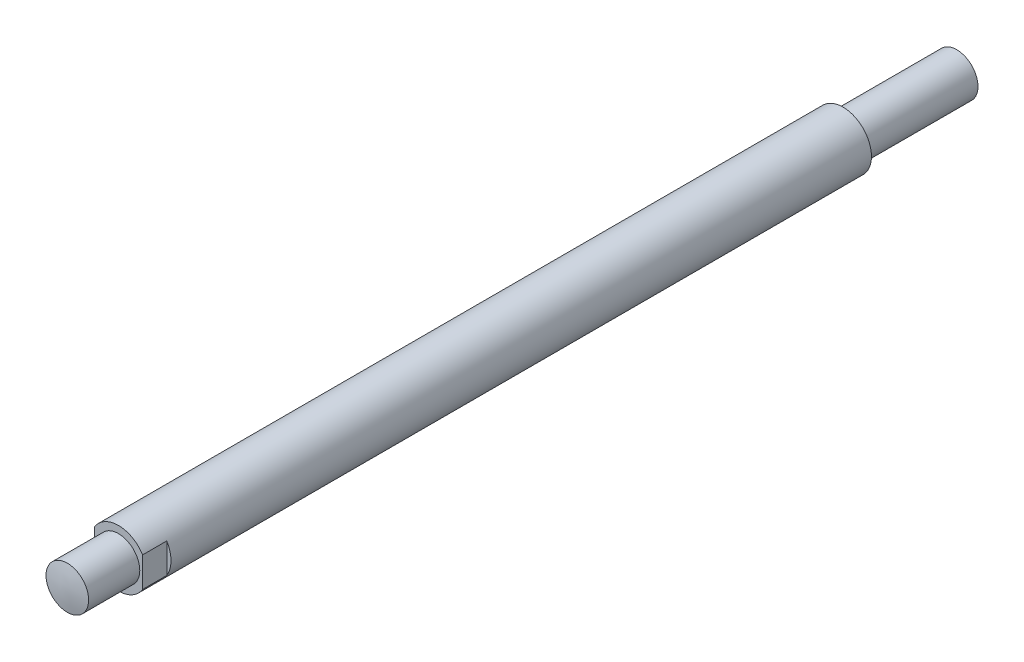
ISO-10303-21;
HEADER;
FILE_DESCRIPTION(('STEP AP214'),'2;1');
FILE_NAME('part.step','',(''),(''),'','','');
FILE_SCHEMA(('AUTOMOTIVE_DESIGN { 1 0 10303 214 1 1 1 1 }'));
ENDSEC;
DATA;
#1=APPLICATION_CONTEXT('core data for automotive mechanical design processes');
#2=APPLICATION_PROTOCOL_DEFINITION('international standard','automotive_design',2000,#1);
#3=PRODUCT_CONTEXT('',#1,'mechanical');
#4=PRODUCT('Part','Part','',(#3));
#5=PRODUCT_RELATED_PRODUCT_CATEGORY('part','',(#4));
#6=PRODUCT_DEFINITION_FORMATION('','',#4);
#7=PRODUCT_DEFINITION_CONTEXT('part definition',#1,'design');
#8=PRODUCT_DEFINITION('design','',#6,#7);
#9=PRODUCT_DEFINITION_SHAPE('','',#8);
#10=(LENGTH_UNIT() NAMED_UNIT(*) SI_UNIT(.MILLI.,.METRE.));
#11=(NAMED_UNIT(*) PLANE_ANGLE_UNIT() SI_UNIT($,.RADIAN.));
#12=(NAMED_UNIT(*) SI_UNIT($,.STERADIAN.) SOLID_ANGLE_UNIT());
#13=UNCERTAINTY_MEASURE_WITH_UNIT(LENGTH_MEASURE(1.E-05),#10,'distance_accuracy_value','');
#14=(GEOMETRIC_REPRESENTATION_CONTEXT(3) GLOBAL_UNCERTAINTY_ASSIGNED_CONTEXT((#13)) GLOBAL_UNIT_ASSIGNED_CONTEXT((#10,
#11,#12)) REPRESENTATION_CONTEXT('',''));
#15=CARTESIAN_POINT('',(0.,0.,0.));
#16=DIRECTION('',(0.,0.,1.));
#17=DIRECTION('',(1.,0.,0.));
#18=AXIS2_PLACEMENT_3D('',#15,#16,#17);
#19=CARTESIAN_POINT('',(0.,0.,255.));
#20=DIRECTION('',(0.,0.,-1.));
#21=DIRECTION('',(-1.,0.,0.));
#22=AXIS2_PLACEMENT_3D('',#19,#20,#21);
#23=CYLINDRICAL_SURFACE('',#22,20.);
#24=CARTESIAN_POINT('',(0.,0.,255.));
#25=DIRECTION('',(0.,0.,1.));
#26=DIRECTION('',(1.,0.,0.));
#27=AXIS2_PLACEMENT_3D('',#24,#25,#26);
#28=CIRCLE('',#27,20.);
#29=CARTESIAN_POINT('',(-17.,-10.5356537528527,255.));
#30=VERTEX_POINT('',#29);
#31=CARTESIAN_POINT('',(17.,-10.5356537528527,255.));
#32=VERTEX_POINT('',#31);
#33=EDGE_CURVE('E205',#30,#32,#28,.T.);
#34=ORIENTED_EDGE('',*,*,#33,.F.);
#35=DIRECTION('',(0.,0.,-1.));
#36=VECTOR('',#35,1.);
#37=CARTESIAN_POINT('',(-17.,-10.5356537528527,255.));
#38=LINE('',#37,#36);
#39=CARTESIAN_POINT('',(-17.,-10.5356537528527,238.));
#40=VERTEX_POINT('',#39);
#41=EDGE_CURVE('E163',#30,#40,#38,.T.);
#42=ORIENTED_EDGE('',*,*,#41,.T.);
#43=CARTESIAN_POINT('',(0.,0.,238.));
#44=DIRECTION('',(0.,0.,-1.));
#45=DIRECTION('',(-1.,0.,0.));
#46=AXIS2_PLACEMENT_3D('',#43,#44,#45);
#47=CIRCLE('',#46,20.);
#48=CARTESIAN_POINT('',(-17.,10.5356537528527,238.));
#49=VERTEX_POINT('',#48);
#50=EDGE_CURVE('E155',#40,#49,#47,.T.);
#51=ORIENTED_EDGE('',*,*,#50,.T.);
#52=DIRECTION('',(0.,0.,-1.));
#53=VECTOR('',#52,1.);
#54=CARTESIAN_POINT('',(-17.,10.5356537528527,255.));
#55=LINE('',#54,#53);
#56=CARTESIAN_POINT('',(-17.,10.5356537528527,255.));
#57=VERTEX_POINT('',#56);
#58=EDGE_CURVE('E389',#49,#57,#55,.F.);
#59=ORIENTED_EDGE('',*,*,#58,.T.);
#60=CARTESIAN_POINT('',(17.,10.5356537528527,255.));
#61=VERTEX_POINT('',#60);
#62=EDGE_CURVE('E213',#61,#57,#28,.T.);
#63=ORIENTED_EDGE('',*,*,#62,.F.);
#64=DIRECTION('',(0.,0.,-1.));
#65=VECTOR('',#64,1.);
#66=CARTESIAN_POINT('',(17.,10.5356537528527,255.));
#67=LINE('',#66,#65);
#68=CARTESIAN_POINT('',(17.,10.5356537528527,238.));
#69=VERTEX_POINT('',#68);
#70=EDGE_CURVE('E171',#61,#69,#67,.T.);
#71=ORIENTED_EDGE('',*,*,#70,.T.);
#72=CARTESIAN_POINT('',(0.,0.,238.));
#73=DIRECTION('',(0.,0.,1.));
#74=DIRECTION('',(1.,0.,0.));
#75=AXIS2_PLACEMENT_3D('',#72,#73,#74);
#76=CIRCLE('',#75,20.);
#77=CARTESIAN_POINT('',(17.,-10.5356537528527,238.));
#78=VERTEX_POINT('',#77);
#79=EDGE_CURVE('E206',#78,#69,#76,.T.);
#80=ORIENTED_EDGE('',*,*,#79,.F.);
#81=DIRECTION('',(0.,0.,-1.));
#82=VECTOR('',#81,1.);
#83=CARTESIAN_POINT('',(17.,-10.5356537528527,255.));
#84=LINE('',#83,#82);
#85=EDGE_CURVE('E191',#78,#32,#84,.F.);
#86=ORIENTED_EDGE('',*,*,#85,.T.);
#87=EDGE_LOOP('',(#34,#42,#51,#59,#63,#71,#80,#86));
#88=FACE_BOUND('',#87,.T.);
#89=CARTESIAN_POINT('',(0.,0.,-255.));
#90=DIRECTION('',(0.,0.,1.));
#91=DIRECTION('',(1.,0.,0.));
#92=AXIS2_PLACEMENT_3D('',#89,#90,#91);
#93=CIRCLE('',#92,20.);
#94=CARTESIAN_POINT('',(20.,0.,-255.));
#95=VERTEX_POINT('',#94);
#96=EDGE_CURVE('E214',#95,#95,#93,.T.);
#97=ORIENTED_EDGE('',*,*,#96,.T.);
#98=EDGE_LOOP('',(#97));
#99=FACE_BOUND('',#98,.T.);
#100=ADVANCED_FACE('F138',(#88,#99),#23,.T.);
#101=CARTESIAN_POINT('',(0.,0.,255.));
#102=DIRECTION('',(0.,0.,1.));
#103=DIRECTION('',(1.,0.,0.));
#104=AXIS2_PLACEMENT_3D('',#101,#102,#103);
#105=PLANE('',#104);
#106=DIRECTION('',(0.,1.,0.));
#107=VECTOR('',#106,1.);
#108=CARTESIAN_POINT('',(-17.,0.,255.));
#109=LINE('',#108,#107);
#110=EDGE_CURVE('E198',#30,#57,#109,.T.);
#111=ORIENTED_EDGE('',*,*,#110,.F.);
#112=ORIENTED_EDGE('',*,*,#33,.T.);
#113=DIRECTION('',(0.,-1.,0.));
#114=VECTOR('',#113,1.);
#115=CARTESIAN_POINT('',(17.,0.,255.));
#116=LINE('',#115,#114);
#117=EDGE_CURVE('E188',#61,#32,#116,.T.);
#118=ORIENTED_EDGE('',*,*,#117,.F.);
#119=ORIENTED_EDGE('',*,*,#62,.T.);
#120=EDGE_LOOP('',(#111,#112,#118,#119));
#121=FACE_BOUND('',#120,.T.);
#122=CARTESIAN_POINT('',(0.,0.,255.));
#123=DIRECTION('',(0.,0.,1.));
#124=DIRECTION('',(1.,0.,0.));
#125=AXIS2_PLACEMENT_3D('',#122,#123,#124);
#126=CIRCLE('',#125,15.);
#127=CARTESIAN_POINT('',(15.,0.,255.));
#128=VERTEX_POINT('',#127);
#129=EDGE_CURVE('E199',#128,#128,#126,.T.);
#130=ORIENTED_EDGE('',*,*,#129,.F.);
#131=EDGE_LOOP('',(#130));
#132=FACE_BOUND('',#131,.T.);
#133=ADVANCED_FACE('F210',(#121,#132),#105,.T.);
#134=CARTESIAN_POINT('',(0.,0.,-255.));
#135=DIRECTION('',(0.,0.,1.));
#136=DIRECTION('',(1.,0.,0.));
#137=AXIS2_PLACEMENT_3D('',#134,#135,#136);
#138=PLANE('',#137);
#139=CARTESIAN_POINT('',(0.,0.,-255.));
#140=DIRECTION('',(0.,0.,-1.));
#141=DIRECTION('',(-1.,0.,0.));
#142=AXIS2_PLACEMENT_3D('',#139,#140,#141);
#143=CIRCLE('',#142,15.);
#144=CARTESIAN_POINT('',(-15.,0.,-255.));
#145=VERTEX_POINT('',#144);
#146=EDGE_CURVE('E13',#145,#145,#143,.T.);
#147=ORIENTED_EDGE('',*,*,#146,.F.);
#148=EDGE_LOOP('',(#147));
#149=FACE_BOUND('',#148,.T.);
#150=ORIENTED_EDGE('',*,*,#96,.F.);
#151=EDGE_LOOP('',(#150));
#152=FACE_BOUND('',#151,.T.);
#153=ADVANCED_FACE('F255',(#149,#152),#138,.F.);
#154=CARTESIAN_POINT('',(0.,0.,291.));
#155=DIRECTION('',(0.,0.,-1.));
#156=DIRECTION('',(-1.,0.,0.));
#157=AXIS2_PLACEMENT_3D('',#154,#155,#156);
#158=CYLINDRICAL_SURFACE('',#157,15.);
#159=CARTESIAN_POINT('',(-15.,6.22115206572182E-13,290.99987129906));
#160=CARTESIAN_POINT('',(-15.000003023853,-0.421429968077825,290.999871195107));
#161=CARTESIAN_POINT('',(-14.9822323766538,-0.842810312725938,290.999885934263));
#162=CARTESIAN_POINT('',(-14.9112738419773,-1.6827165523157,290.999938409822));
#163=CARTESIAN_POINT('',(-14.8580766370507,-2.10124166704795,290.999976152273));
#164=CARTESIAN_POINT('',(-14.7165536864597,-2.93276682212971,291.000058765728));
#165=CARTESIAN_POINT('',(-14.6281901845041,-3.34576042934893,291.000103644362));
#166=CARTESIAN_POINT('',(-14.4169655841019,-4.1628297430775,291.000181776484));
#167=CARTESIAN_POINT('',(-14.2941046103744,-4.56690548182202,291.000215030014));
#168=CARTESIAN_POINT('',(-14.0148269284681,-5.36306909865374,291.000257479866));
#169=CARTESIAN_POINT('',(-13.8584264957458,-5.75516268617127,291.000266687828));
#170=CARTESIAN_POINT('',(-13.5131442516947,-6.52478498545492,291.000261300724));
#171=CARTESIAN_POINT('',(-13.324261927443,-6.90231346710758,291.000246705281));
#172=CARTESIAN_POINT('',(-12.9154129806584,-7.64001993329824,291.00020669812));
#173=CARTESIAN_POINT('',(-12.6954542926542,-8.00020231532584,291.000181289159));
#174=CARTESIAN_POINT('',(-12.2259806463232,-8.70075815353112,291.000138025461));
#175=CARTESIAN_POINT('',(-11.9764658036638,-9.04113168722254,291.000120170693));
#176=CARTESIAN_POINT('',(-11.4496245957236,-9.6996870942965,291.000104023798));
#177=CARTESIAN_POINT('',(-11.1722952780295,-10.0178666057674,291.000105733751));
#178=CARTESIAN_POINT('',(-10.59181850848,-10.629732554616,291.000125099075));
#179=CARTESIAN_POINT('',(-10.2886710304257,-10.9234189671388,291.000142754463));
#180=CARTESIAN_POINT('',(-9.65870101247631,-11.4842214392565,291.000175221778));
#181=CARTESIAN_POINT('',(-9.33187755155794,-11.7513364642334,291.000190033594));
#182=CARTESIAN_POINT('',(-8.65688967647293,-12.2570840089198,291.000195526217));
#183=CARTESIAN_POINT('',(-8.30872526652063,-12.4957165342539,291.000186207027));
#184=CARTESIAN_POINT('',(-7.5935374164228,-12.9427983902209,291.000138177528));
#185=CARTESIAN_POINT('',(-7.22651432644996,-13.1512482810183,291.000099467764));
#186=CARTESIAN_POINT('',(-6.47621248377215,-13.5364881903353,291.000014770293));
#187=CARTESIAN_POINT('',(-6.09293373076974,-13.7132782082756,290.999968782586));
#188=CARTESIAN_POINT('',(-5.31284624377602,-14.0339411690287,290.999907092489));
#189=CARTESIAN_POINT('',(-4.9160375371585,-14.1778141784345,290.999891390038));
#190=CARTESIAN_POINT('',(-4.11171047808972,-14.4316207298817,290.999912906413));
#191=CARTESIAN_POINT('',(-3.70419212563181,-14.541554271902,290.999950125239));
#192=CARTESIAN_POINT('',(-2.88134222788374,-14.7267004980474,291.000017958233));
#193=CARTESIAN_POINT('',(-2.46601066834727,-14.8019131188572,291.000048572389));
#194=CARTESIAN_POINT('',(-1.63048784177797,-14.917082489281,291.000102647852));
#195=CARTESIAN_POINT('',(-1.2102965747522,-14.9570392389461,291.000126109158));
#196=CARTESIAN_POINT('',(-0.368042405503726,-15.0014127581682,291.000153315987));
#197=CARTESIAN_POINT('',(0.0540204933419018,-15.0058295918255,291.000157061545));
#198=CARTESIAN_POINT('',(0.897018070131701,-14.9790920464044,291.000139588416));
#199=CARTESIAN_POINT('',(1.31795274807631,-14.9479376673397,291.000118369729));
#200=CARTESIAN_POINT('',(2.15570146935681,-14.8502791648418,291.000070829718));
#201=CARTESIAN_POINT('',(2.57251551099022,-14.7837750268042,291.000044508393));
#202=CARTESIAN_POINT('',(3.39905948767221,-14.6158898018184,290.999975832651));
#203=CARTESIAN_POINT('',(3.80878942272485,-14.5145087148904,290.999933478235));
#204=CARTESIAN_POINT('',(4.61825268788101,-14.2775902232919,290.999893386758));
#205=CARTESIAN_POINT('',(5.01798600741592,-14.1420527825125,290.999895649744));
#206=CARTESIAN_POINT('',(5.8046137208888,-13.8377852284714,290.999940084002));
#207=CARTESIAN_POINT('',(6.19150811478666,-13.6690551151061,290.999982255275));
#208=CARTESIAN_POINT('',(6.94970725001441,-13.299601854345,291.000067988841));
#209=CARTESIAN_POINT('',(7.32101199704283,-13.0988787186438,291.000111551133));
#210=CARTESIAN_POINT('',(8.04539223493369,-12.6668663895322,291.000172240198));
#211=CARTESIAN_POINT('',(8.39846772585324,-12.4355771962174,291.00018936697));
#212=CARTESIAN_POINT('',(9.0838791563402,-11.9440771797302,291.00019599619));
#213=CARTESIAN_POINT('',(9.41621510429417,-11.6838663682531,291.00018549865));
#214=CARTESIAN_POINT('',(10.0577848967138,-11.1363729810776,291.000155903631));
#215=CARTESIAN_POINT('',(10.3670187411455,-10.8490904053395,291.000136806153));
#216=CARTESIAN_POINT('',(10.9601859157358,-10.249495839324,291.000111007691));
#217=CARTESIAN_POINT('',(11.2441192412093,-9.9371838444118,291.00010430671));
#218=CARTESIAN_POINT('',(11.7846667177481,-9.28975083734459,291.000111225049));
#219=CARTESIAN_POINT('',(12.0412808688124,-8.95462982518876,291.00012484437));
#220=CARTESIAN_POINT('',(12.5253656553835,-8.26396124827642,291.000163678486));
#221=CARTESIAN_POINT('',(12.7528362871188,-7.90841368087649,291.000188893284));
#222=CARTESIAN_POINT('',(13.177016816848,-7.17941976222282,291.000232982952));
#223=CARTESIAN_POINT('',(13.3737267148503,-6.80597341097401,291.000251857823));
#224=CARTESIAN_POINT('',(13.7349872900809,-6.04383689886513,291.000268006283));
#225=CARTESIAN_POINT('',(13.8995379668769,-5.65514673780018,291.000265279873));
#226=CARTESIAN_POINT('',(14.1953102391458,-4.86528596625443,291.000234551077));
#227=CARTESIAN_POINT('',(14.326531834607,-4.46411535576924,291.000206548691));
#228=CARTESIAN_POINT('',(14.5547130321658,-3.65214578748583,291.00013494383));
#229=CARTESIAN_POINT('',(14.6516726358398,-3.24134683013057,291.000091341357));
#230=CARTESIAN_POINT('',(14.8106405342143,-2.41304108277874,291.000006444384));
#231=CARTESIAN_POINT('',(14.8726488289185,-1.99553429278285,290.999965149885));
#232=CARTESIAN_POINT('',(14.9612732662616,-1.15678111318917,290.999902377382));
#233=CARTESIAN_POINT('',(14.9878894098898,-0.735534723695897,290.999880899378));
#234=CARTESIAN_POINT('',(15.0055403230706,0.107702856102805,290.999866921279));
#235=CARTESIAN_POINT('',(14.9965750926411,0.529694046407862,290.999874421185));
#236=CARTESIAN_POINT('',(14.9431269941042,1.3714211413011,290.999915198171));
#237=CARTESIAN_POINT('',(14.8986441243681,1.79115704578586,290.999948475252));
#238=CARTESIAN_POINT('',(14.7744769920395,2.62538947961232,291.000026636369));
#239=CARTESIAN_POINT('',(14.6947927294096,3.03988600894842,291.000071520405));
#240=CARTESIAN_POINT('',(14.5007893223723,3.86069285500749,291.000154055991));
#241=CARTESIAN_POINT('',(14.3864701794219,4.26700317207481,291.000191707542));
#242=CARTESIAN_POINT('',(14.124009750675,5.06854898918191,291.000245057162));
#243=CARTESIAN_POINT('',(13.9758684649253,5.46378448923702,291.000260755231));
#244=CARTESIAN_POINT('',(13.6468169679929,6.24037073333447,291.000266983025));
#245=CARTESIAN_POINT('',(13.4659067611032,6.62172147919579,291.000257512753));
#246=CARTESIAN_POINT('',(13.0726035718547,7.36782709491791,291.000223625575));
#247=CARTESIAN_POINT('',(12.8602105894636,7.73258196476169,291.000199208668));
#248=CARTESIAN_POINT('',(12.4054518582059,8.44290260542737,291.000153485927));
#249=CARTESIAN_POINT('',(12.1630861123737,8.78846837819205,291.000132180093));
#250=CARTESIAN_POINT('',(11.6501049112967,9.45795410047979,291.000107372599));
#251=CARTESIAN_POINT('',(11.3794894560728,9.78187405001891,291.00010387094));
#252=CARTESIAN_POINT('',(10.811932634142,10.40576537647,291.000115361002));
#253=CARTESIAN_POINT('',(10.514991256771,10.7057367436808,291.000130352732));
#254=CARTESIAN_POINT('',(9.89689375972168,11.279598142863,291.000163058733));
#255=CARTESIAN_POINT('',(9.57573764002441,11.5534881748139,291.000180773004));
#256=CARTESIAN_POINT('',(8.9114937523128,12.0732398137625,291.000196573456));
#257=CARTESIAN_POINT('',(8.56840597549132,12.3191014095046,291.000194659629));
#258=CARTESIAN_POINT('',(7.86273804161008,12.7810481177248,291.000160335082));
#259=CARTESIAN_POINT('',(7.50015788453539,12.9971332301802,291.000127924363));
#260=CARTESIAN_POINT('',(6.75808331431599,13.3979905224256,291.000048059792));
#261=CARTESIAN_POINT('',(6.37858891905904,13.5827627353298,291.000000605955));
#262=CARTESIAN_POINT('',(5.60538348773505,13.9196808897955,290.999926215166));
#263=CARTESIAN_POINT('',(5.21167245173582,14.0718268315126,290.999899278213));
#264=CARTESIAN_POINT('',(4.41283295431708,14.3424107209691,290.999898887694));
#265=CARTESIAN_POINT('',(4.00770449769535,14.4608486828729,290.999925434104));
#266=CARTESIAN_POINT('',(3.18891021518704,14.6631746771356,290.999988536243));
#267=CARTESIAN_POINT('',(2.77524438926042,14.7470627093325,291.000025091972));
#268=CARTESIAN_POINT('',(1.94231552592842,14.8796925710995,291.000085831727));
#269=CARTESIAN_POINT('',(1.52305247842976,14.9284343372828,291.000110015731));
#270=CARTESIAN_POINT('',(0.681910618431834,14.9904248946712,291.000145026733));
#271=CARTESIAN_POINT('',(0.260031805935818,15.0036736859204,291.00015585373));
#272=CARTESIAN_POINT('',(-0.583341476194791,14.9945841111104,291.000149725787));
#273=CARTESIAN_POINT('',(-1.00483594655359,14.9722458122463,291.000132770899));
#274=CARTESIAN_POINT('',(-1.84444477679033,14.8921409947783,291.000091158511));
#275=CARTESIAN_POINT('',(-2.26255913665864,14.8343744760735,291.000066501012));
#276=CARTESIAN_POINT('',(-3.09243604897057,14.6838237508151,291.00000038854));
#277=CARTESIAN_POINT('',(-3.50419858855427,14.5910394733741,290.999958933534));
#278=CARTESIAN_POINT('',(-4.31844359576085,14.3711128854574,290.9999051331));
#279=CARTESIAN_POINT('',(-4.72092606358801,14.2439705757381,290.99989278767));
#280=CARTESIAN_POINT('',(-5.51375688026376,13.9562291582867,290.999916394736));
#281=CARTESIAN_POINT('',(-5.90410500385817,13.7956294298984,290.999952348128));
#282=CARTESIAN_POINT('',(-6.66988414950832,13.4421163793829,291.000034873332));
#283=CARTESIAN_POINT('',(-7.04531516860287,13.2492030508411,291.000081445146));
#284=CARTESIAN_POINT('',(-7.77857654530421,12.8324424964519,291.000152925003));
#285=CARTESIAN_POINT('',(-8.13640758735183,12.6085964748295,291.000177833889));
#286=CARTESIAN_POINT('',(-8.83194045537133,12.1315564087121,291.000197821863));
#287=CARTESIAN_POINT('',(-9.16964230174427,11.8783623939622,291.00019290098));
#288=CARTESIAN_POINT('',(-9.82248168315003,11.3444545442219,291.000168815355));
#289=CARTESIAN_POINT('',(-10.1376216120689,11.0637436363653,291.000149652125));
#290=CARTESIAN_POINT('',(-10.7431379553376,10.4767735321747,291.000119301994));
#291=CARTESIAN_POINT('',(-11.0335142728196,10.1705142359123,291.000108115123));
#292=CARTESIAN_POINT('',(-11.5875088054246,9.53454386866956,291.000105724729));
#293=CARTESIAN_POINT('',(-11.8511201802227,9.20482683902291,291.0001145263));
#294=CARTESIAN_POINT('',(-12.3496218409199,8.52436055425957,291.000147180727));
#295=CARTESIAN_POINT('',(-12.5845125802574,8.17361163132261,291.000171033345));
#296=CARTESIAN_POINT('',(-13.0240141265274,7.45339575805495,291.000217071532));
#297=CARTESIAN_POINT('',(-13.228610209612,7.08391982233009,291.000239256288));
#298=CARTESIAN_POINT('',(-13.6059305610376,6.32903740672225,291.000264938466));
#299=CARTESIAN_POINT('',(-13.7786547141835,5.94363086926724,291.000268435822));
#300=CARTESIAN_POINT('',(-14.0908337365904,5.1600448164501,291.000249737515));
#301=CARTESIAN_POINT('',(-14.2303241838782,4.76187948286193,291.000227569478));
#302=CARTESIAN_POINT('',(-14.4752485925894,3.95535009793403,291.0001641994));
#303=CARTESIAN_POINT('',(-14.5806915025828,3.54698875681508,291.000123002366));
#304=CARTESIAN_POINT('',(-14.7787530801441,2.62017976737135,291.000027648862));
#305=CARTESIAN_POINT('',(-14.8616502646507,2.09962614046302,290.999972818673));
#306=CARTESIAN_POINT('',(-14.9722718363185,1.05268921071956,290.999894708684));
#307=CARTESIAN_POINT('',(-14.999996223639,0.526305907901286,290.999871428883));
#308=CARTESIAN_POINT('',(-15.,6.22115206572182E-13,290.99987129906));
#309=B_SPLINE_CURVE_WITH_KNOTS('',3,(#159,#160,#161,#162,#163,#164,#165,#166,#167,#168,#169,
#170,#171,#172,#173,#174,#175,#176,#177,#178,#179,#180,#181,#182,#183,#184,#185,#186,#187,#188,
#189,#190,#191,#192,#193,#194,#195,#196,#197,#198,#199,#200,#201,#202,#203,#204,#205,#206,#207,
#208,#209,#210,#211,#212,#213,#214,#215,#216,#217,#218,#219,#220,#221,#222,#223,#224,#225,#226,
#227,#228,#229,#230,#231,#232,#233,#234,#235,#236,#237,#238,#239,#240,#241,#242,#243,#244,#245,
#246,#247,#248,#249,#250,#251,#252,#253,#254,#255,#256,#257,#258,#259,#260,#261,#262,#263,#264,
#265,#266,#267,#268,#269,#270,#271,#272,#273,#274,#275,#276,#277,#278,#279,#280,#281,#282,#283,
#284,#285,#286,#287,#288,#289,#290,#291,#292,#293,#294,#295,#296,#297,#298,#299,#300,#301,#302,
#303,#304,#305,#306,#307,#308),.UNSPECIFIED.,.T.,.F.,(4,2,2,2,2,2,2,2,2,2,2,2,2,2,2,2,2,2,2,2,2,
2,2,2,2,2,2,2,2,2,2,2,2,2,2,2,2,2,2,2,2,2,2,2,2,2,2,2,2,2,2,2,2,2,2,2,2,2,2,2,2,2,2,2,2,2,2,2,2,
2,2,2,2,2,4),(0.,1.26383017673718,2.52799288159395,3.79351653214919,5.05903560750109,
6.32394195740895,7.58886828334004,8.85347222544869,10.1180712187194,11.3828045872879,
12.6475392392539,13.9123231173129,15.1771067456072,16.4418668975635,17.7066270726615,
18.9713846890499,20.236142306226,21.5009022297391,22.7656621514181,24.0304197919611,
25.2951774320146,26.5599355945902,27.8246937564385,29.0894532553562,30.3542127582259,
31.6189717987806,32.8837308353732,34.1484893605248,35.413247887531,36.678006648736,
37.942765409986,39.207524334911,40.4722832594889,41.7370422010659,43.0018011430866,
44.2665600269175,45.5313189106165,46.7960777589631,48.0608366066695,49.3255955123761,
50.5903544194333,51.8551132732855,53.1198721253854,54.3846308117941,55.6493894995002,
56.9141480591572,58.178906617875,59.4436656889179,60.7084247609453,61.9731843408671,
63.2379439217571,64.5027021651247,65.7674604024603,67.0322181083339,68.29697582014,
69.5617358129509,70.826495804193,72.0912534073339,73.3560110140786,74.6207711811219,
75.885531320323,77.1503149237157,78.4150987781796,79.6798334078482,80.9445667556785,
82.2091657120774,83.4737696149747,84.7386959038305,86.0036022195795,87.2691213029292,
88.5346449601721,89.7988076735906,91.0626378615271,92.6409814557275,94.2193250453702),.UNSPECIFIED.);
#310=CARTESIAN_POINT('',(-15.,6.22115206572182E-13,290.99987129906));
#311=VERTEX_POINT('',#310);
#312=EDGE_CURVE('E219',#311,#311,#309,.T.);
#313=ORIENTED_EDGE('',*,*,#312,.F.);
#314=EDGE_LOOP('',(#313));
#315=FACE_BOUND('',#314,.T.);
#316=ORIENTED_EDGE('',*,*,#129,.T.);
#317=EDGE_LOOP('',(#316));
#318=FACE_BOUND('',#317,.T.);
#319=ADVANCED_FACE('F236',(#315,#318),#158,.T.);
#320=CARTESIAN_POINT('',(15.5810035224534,-15.2999963314842,289.633783826157));
#321=CARTESIAN_POINT('',(13.0880492361213,-15.2999963314842,289.959677684014));
#322=CARTESIAN_POINT('',(10.5950949497891,-15.2999963314842,290.261630255632));
#323=CARTESIAN_POINT('',(8.10214066345694,-15.2999963314842,290.545832647078));
#324=CARTESIAN_POINT('',(4.36270400291303,-15.2999963314842,290.862661343484));
#325=CARTESIAN_POINT('',(0.623267342369116,-15.2999963314842,290.948560604612));
#326=CARTESIAN_POINT('',(-0.623215031842646,-15.2999963314842,290.948561018402));
#327=CARTESIAN_POINT('',(-4.36266215447793,-15.2999963314842,290.862664300139));
#328=CARTESIAN_POINT('',(-8.10210927711322,-15.2999963314842,290.545836465088));
#329=CARTESIAN_POINT('',(-10.5950740255367,-15.2999963314842,290.261632627076));
#330=CARTESIAN_POINT('',(-13.0880387739603,-15.2999963314842,289.959678956893));
#331=CARTESIAN_POINT('',(-15.5810035223838,-15.2999963314842,289.633783848937));
#332=CARTESIAN_POINT('',(15.5810035224534,-9.17999779890314,290.503559833661));
#333=CARTESIAN_POINT('',(13.0880492361213,-9.17999779890314,290.928294237446));
#334=CARTESIAN_POINT('',(10.5950949497891,-9.17999779890314,291.330039201665));
#335=CARTESIAN_POINT('',(8.10214066345694,-9.17999779890314,291.731063186466));
#336=CARTESIAN_POINT('',(4.36270400291303,-9.17999779890314,292.178629944891));
#337=CARTESIAN_POINT('',(0.623267342369116,-9.17999779890314,292.295818627697));
#338=CARTESIAN_POINT('',(-0.623215031842646,-9.17999779890314,292.295819314185));
#339=CARTESIAN_POINT('',(-4.36266215447793,-9.17999779890314,292.178634330608));
#340=CARTESIAN_POINT('',(-8.10210927711322,-9.17999779890314,291.731068290838));
#341=CARTESIAN_POINT('',(-10.5950740255367,-9.17999779890314,291.330042293883));
#342=CARTESIAN_POINT('',(-13.0880387739603,-9.17999779890314,290.928296032514));
#343=CARTESIAN_POINT('',(-15.5810035223838,-9.17999779890314,290.503559999305));
#344=CARTESIAN_POINT('',(15.5810035224534,-3.05999926632202,291.208907883705));
#345=CARTESIAN_POINT('',(13.0880492361213,-3.05999926632202,291.719875363506));
#346=CARTESIAN_POINT('',(10.5950949497891,-3.05999926632202,292.223144705267));
#347=CARTESIAN_POINT('',(8.10214066345694,-3.05999926632202,292.733093968407));
#348=CARTESIAN_POINT('',(4.36270400291303,-3.05999926632202,293.393492431047));
#349=CARTESIAN_POINT('',(0.623267342369116,-3.05999926632202,293.6007677267));
#350=CARTESIAN_POINT('',(-0.623215031842646,-3.05999926632202,293.600768918468));
#351=CARTESIAN_POINT('',(-4.36266215447793,-3.05999926632202,293.393499100946));
#352=CARTESIAN_POINT('',(-8.10210927711322,-3.05999926632202,292.733100224463));
#353=CARTESIAN_POINT('',(-10.5950740255367,-3.05999926632202,292.223149935709));
#354=CARTESIAN_POINT('',(-13.0880387739603,-3.05999926632202,291.719877797031));
#355=CARTESIAN_POINT('',(-15.5810035223838,-3.05999926632202,291.208907290504));
#356=CARTESIAN_POINT('',(15.5810035224534,3.05999926625909,291.208907309887));
#357=CARTESIAN_POINT('',(13.0880492361213,3.05999926625909,291.719875666901));
#358=CARTESIAN_POINT('',(10.5950949497891,3.05999926625909,292.223145717149));
#359=CARTESIAN_POINT('',(8.10214066345694,3.05999926625909,292.733093627154));
#360=CARTESIAN_POINT('',(4.36270400291303,3.05999926625909,293.39349224213));
#361=CARTESIAN_POINT('',(0.623267342369116,3.05999926625909,293.600767668395));
#362=CARTESIAN_POINT('',(-0.623215031842646,3.05999926625909,293.600768976807));
#363=CARTESIAN_POINT('',(-4.36266215447793,3.05999926625909,293.393499289897));
#364=CARTESIAN_POINT('',(-8.10210927711322,3.05999926625909,292.733100565753));
#365=CARTESIAN_POINT('',(-10.5950740255367,3.05999926625909,292.223148923844));
#366=CARTESIAN_POINT('',(-13.0880387739603,3.05999926625909,291.71987749365));
#367=CARTESIAN_POINT('',(-15.5810035223838,3.05999926625909,291.208907864336));
#368=CARTESIAN_POINT('',(15.5810035224534,9.17999779884021,290.503559953547));
#369=CARTESIAN_POINT('',(13.0880492361213,9.17999779884021,290.928294237266));
#370=CARTESIAN_POINT('',(10.5950949497891,9.17999779884021,291.330038941031));
#371=CARTESIAN_POINT('',(8.10214066345694,9.17999779884021,291.731063168994));
#372=CARTESIAN_POINT('',(4.36270400291303,9.17999779884021,292.178630083906));
#373=CARTESIAN_POINT('',(0.623267342369116,9.17999779884021,292.295818697338));
#374=CARTESIAN_POINT('',(-0.623215031842646,9.17999779884021,292.295819244596));
#375=CARTESIAN_POINT('',(-4.36266215447793,9.17999779884021,292.178634191634));
#376=CARTESIAN_POINT('',(-8.10210927711322,9.17999779884021,291.731068308344));
#377=CARTESIAN_POINT('',(-10.5950740255367,9.17999779884021,291.330042554549));
#378=CARTESIAN_POINT('',(-13.0880387739603,9.17999779884021,290.928296032717));
#379=CARTESIAN_POINT('',(-15.5810035223838,9.17999779884021,290.503559879434));
#380=CARTESIAN_POINT('',(15.5810035224534,15.2999963314213,289.633783853679));
#381=CARTESIAN_POINT('',(13.0880492361213,15.2999963314213,289.959677632097));
#382=CARTESIAN_POINT('',(10.5950949497891,15.2999963314213,290.261630158052));
#383=CARTESIAN_POINT('',(8.10214066345694,15.2999963314213,290.545832843288));
#384=CARTESIAN_POINT('',(4.36270400291303,15.2999963314213,290.862661253343));
#385=CARTESIAN_POINT('',(0.623267342369116,15.2999963314213,290.948560534839));
#386=CARTESIAN_POINT('',(-0.623215031842646,15.2999963314213,290.948561088197));
#387=CARTESIAN_POINT('',(-4.36266215447793,15.2999963314213,290.86266439031));
#388=CARTESIAN_POINT('',(-8.10210927711322,15.2999963314213,290.545836268891));
#389=CARTESIAN_POINT('',(-10.5950740255367,15.2999963314213,290.261632724665));
#390=CARTESIAN_POINT('',(-13.0880387739603,15.2999963314213,289.959679008811));
#391=CARTESIAN_POINT('',(-15.5810035223838,15.2999963314213,289.633783821406));
#392=B_SPLINE_SURFACE_WITH_KNOTS('',5,5,((#320,#321,#322,#323,#324,#325,#326,#327,#328,#329,
#330,#331),(#332,#333,#334,#335,#336,#337,#338,#339,#340,#341,#342,#343),(#344,#345,#346,#347,
#348,#349,#350,#351,#352,#353,#354,#355),(#356,#357,#358,#359,#360,#361,#362,#363,#364,#365,
#366,#367),(#368,#369,#370,#371,#372,#373,#374,#375,#376,#377,#378,#379),(#380,#381,#382,#383,
#384,#385,#386,#387,#388,#389,#390,#391)),.UNSPECIFIED.,.F.,.F.,.F.,(6,6),(6,3,3,6),
(-15.2999963314879,15.2999963314177),(-15.581003522453,-3.11623209079224,3.11617978026657,
15.5810035223842),.UNSPECIFIED.);
#393=ORIENTED_EDGE('',*,*,#312,.T.);
#394=EDGE_LOOP('',(#393));
#395=FACE_BOUND('',#394,.T.);
#396=ADVANCED_FACE('F240',(#395),#392,.T.);
#397=CARTESIAN_POINT('',(0.,0.,238.));
#398=DIRECTION('',(0.,0.,1.));
#399=DIRECTION('',(1.,0.,0.));
#400=AXIS2_PLACEMENT_3D('',#397,#398,#399);
#401=PLANE('',#400);
#402=ORIENTED_EDGE('',*,*,#79,.T.);
#403=DIRECTION('',(0.,-1.,0.));
#404=VECTOR('',#403,1.);
#405=CARTESIAN_POINT('',(17.,21.6797466022286,238.));
#406=LINE('',#405,#404);
#407=EDGE_CURVE('E380',#69,#78,#406,.T.);
#408=ORIENTED_EDGE('',*,*,#407,.T.);
#409=EDGE_LOOP('',(#402,#408));
#410=FACE_BOUND('',#409,.T.);
#411=ADVANCED_FACE('F246',(#410),#401,.T.);
#412=CARTESIAN_POINT('',(17.,21.6797466022286,238.));
#413=DIRECTION('',(-1.,0.,0.));
#414=DIRECTION('',(0.,-1.,0.));
#415=AXIS2_PLACEMENT_3D('',#412,#413,#414);
#416=PLANE('',#415);
#417=ORIENTED_EDGE('',*,*,#117,.T.);
#418=ORIENTED_EDGE('',*,*,#85,.F.);
#419=ORIENTED_EDGE('',*,*,#407,.F.);
#420=ORIENTED_EDGE('',*,*,#70,.F.);
#421=EDGE_LOOP('',(#417,#418,#419,#420));
#422=FACE_BOUND('',#421,.T.);
#423=ADVANCED_FACE('F190',(#422),#416,.F.);
#424=CARTESIAN_POINT('',(0.,0.,238.));
#425=DIRECTION('',(0.,0.,-1.));
#426=DIRECTION('',(-1.,0.,0.));
#427=AXIS2_PLACEMENT_3D('',#424,#425,#426);
#428=PLANE('',#427);
#429=DIRECTION('',(0.,1.,0.));
#430=VECTOR('',#429,1.);
#431=CARTESIAN_POINT('',(-17.,21.6797466022286,238.));
#432=LINE('',#431,#430);
#433=EDGE_CURVE('E208',#40,#49,#432,.T.);
#434=ORIENTED_EDGE('',*,*,#433,.T.);
#435=ORIENTED_EDGE('',*,*,#50,.F.);
#436=EDGE_LOOP('',(#434,#435));
#437=FACE_BOUND('',#436,.T.);
#438=ADVANCED_FACE('F293',(#437),#428,.F.);
#439=CARTESIAN_POINT('',(-17.,21.6797466022286,238.));
#440=DIRECTION('',(1.,0.,0.));
#441=DIRECTION('',(0.,1.,0.));
#442=AXIS2_PLACEMENT_3D('',#439,#440,#441);
#443=PLANE('',#442);
#444=ORIENTED_EDGE('',*,*,#110,.T.);
#445=ORIENTED_EDGE('',*,*,#58,.F.);
#446=ORIENTED_EDGE('',*,*,#433,.F.);
#447=ORIENTED_EDGE('',*,*,#41,.F.);
#448=EDGE_LOOP('',(#444,#445,#446,#447));
#449=FACE_BOUND('',#448,.T.);
#450=ADVANCED_FACE('F300',(#449),#443,.F.);
#451=CARTESIAN_POINT('',(0.,0.,-335.));
#452=DIRECTION('',(0.,0.,1.));
#453=DIRECTION('',(1.,0.,0.));
#454=AXIS2_PLACEMENT_3D('',#451,#452,#453);
#455=CYLINDRICAL_SURFACE('',#454,15.);
#456=CARTESIAN_POINT('',(15.,6.22982568310171E-13,-334.999871299168));
#457=CARTESIAN_POINT('',(15.000003023853,-0.421429968077905,-334.999871195215));
#458=CARTESIAN_POINT('',(14.9822323766538,-0.842810312726099,-334.999885934333));
#459=CARTESIAN_POINT('',(14.9112738419773,-1.68271655231603,-334.999938409762));
#460=CARTESIAN_POINT('',(14.8580766370506,-2.10124166704836,-334.999976152124));
#461=CARTESIAN_POINT('',(14.7165536864595,-2.9327668221303,-335.000058765411));
#462=CARTESIAN_POINT('',(14.6281901845039,-3.34576042934961,-335.000103643967));
#463=CARTESIAN_POINT('',(14.4169655841017,-4.16282974307834,-335.000181776007));
#464=CARTESIAN_POINT('',(14.2941046103741,-4.56690548182293,-335.000215029533));
#465=CARTESIAN_POINT('',(14.0148269284677,-5.36306909865479,-335.000257479479));
#466=CARTESIAN_POINT('',(13.8584264957454,-5.75516268617239,-335.000266687539));
#467=CARTESIAN_POINT('',(13.5131442516941,-6.52478498545617,-335.000261300698));
#468=CARTESIAN_POINT('',(13.3242619274423,-6.90231346710888,-335.000246705422));
#469=CARTESIAN_POINT('',(12.9154129806575,-7.64001993329966,-335.000206698581));
#470=CARTESIAN_POINT('',(12.6954542926533,-8.0002023153273,-335.000181289775));
#471=CARTESIAN_POINT('',(12.2259806463221,-8.70075815353266,-335.000138026276));
#472=CARTESIAN_POINT('',(11.9764658036626,-9.04113168722412,-335.000120171554));
#473=CARTESIAN_POINT('',(11.4496245957222,-9.69968709429815,-335.000104024578));
#474=CARTESIAN_POINT('',(11.172295278028,-10.0178666057691,-335.000105734403));
#475=CARTESIAN_POINT('',(10.5918185084783,-10.6297325546177,-335.000125099312));
#476=CARTESIAN_POINT('',(10.2886710304239,-10.9234189671405,-335.000142754412));
#477=CARTESIAN_POINT('',(9.65870101247426,-11.4842214392582,-335.000175221117));
#478=CARTESIAN_POINT('',(9.33187755155577,-11.7513364642351,-335.000190032611));
#479=CARTESIAN_POINT('',(8.65688967647053,-12.2570840089215,-335.000195524782));
#480=CARTESIAN_POINT('',(8.3087252665181,-12.4957165342556,-335.000186205464));
#481=CARTESIAN_POINT('',(7.59353741641971,-12.9427983902227,-335.000138176192));
#482=CARTESIAN_POINT('',(7.2265143264464,-13.1512482810203,-335.000099466783));
#483=CARTESIAN_POINT('',(6.47621248376758,-13.5364881903375,-335.000014770634));
#484=CARTESIAN_POINT('',(6.09293373076463,-13.7132782082779,-334.999968783892));
#485=CARTESIAN_POINT('',(5.31284624376988,-14.033941169031,-334.999907096187));
#486=CARTESIAN_POINT('',(4.91603753715186,-14.1778141784368,-334.999891395162));
#487=CARTESIAN_POINT('',(4.11171047808217,-14.4316207298839,-334.999912913155));
#488=CARTESIAN_POINT('',(3.70419212562382,-14.5415542719041,-334.999950132174));
#489=CARTESIAN_POINT('',(2.88134222787124,-14.72670049805,-335.000017963231));
#490=CARTESIAN_POINT('',(2.46601066833062,-14.8019131188601,-335.000048575257));
#491=CARTESIAN_POINT('',(1.63048784175313,-14.9170824892839,-335.000102648353));
#492=CARTESIAN_POINT('',(1.21029657472331,-14.9570392389486,-335.000126109422));
#493=CARTESIAN_POINT('',(0.36804240546679,-15.0014127581693,-335.000153316011));
#494=CARTESIAN_POINT('',(-0.0540204933828416,-15.0058295918255,-335.000157061566));
#495=CARTESIAN_POINT('',(-0.897018070180487,-14.9790920464016,-335.000139588296));
#496=CARTESIAN_POINT('',(-1.31795274812894,-14.9479376673352,-335.000118369471));
#497=CARTESIAN_POINT('',(-2.15570146941376,-14.8502791648336,-335.000070827803));
#498=CARTESIAN_POINT('',(-2.5725155110477,-14.7837750267942,-335.000044504959));
#499=CARTESIAN_POINT('',(-3.39905948773056,-14.6158898018049,-334.999975826773));
#500=CARTESIAN_POINT('',(-3.80878942278355,-14.514508714875,-334.999933471433));
#501=CARTESIAN_POINT('',(-4.61825268794029,-14.2775902232728,-334.999893380553));
#502=CARTESIAN_POINT('',(-5.01798600747542,-14.1420527824914,-334.999895645061));
#503=CARTESIAN_POINT('',(-5.80461372094849,-13.8377852284464,-334.99994008191));
#504=CARTESIAN_POINT('',(-6.1915081148463,-13.6690551150791,-334.999982254251));
#505=CARTESIAN_POINT('',(-6.94970725007126,-13.2996018543152,-335.000067989404));
#506=CARTESIAN_POINT('',(-7.32101199709703,-13.0988787186135,-335.000111552216));
#507=CARTESIAN_POINT('',(-8.04539223498265,-12.666866389501,-335.000172241762));
#508=CARTESIAN_POINT('',(-8.39846772589961,-12.435577196186,-335.000189368495));
#509=CARTESIAN_POINT('',(-9.08387915638147,-11.9440771796988,-335.000195997379));
#510=CARTESIAN_POINT('',(-9.41621510433294,-11.6838663682218,-335.00018549954));
#511=CARTESIAN_POINT('',(-10.0577848967477,-11.1363729810469,-335.000155903911));
#512=CARTESIAN_POINT('',(-10.367018741177,-10.8490904053093,-335.00013680612));
#513=CARTESIAN_POINT('',(-10.9601859157632,-10.2494958392946,-335.000111007173));
#514=CARTESIAN_POINT('',(-11.2441192412349,-9.93718384438271,-335.00010430602));
#515=CARTESIAN_POINT('',(-11.7846667177703,-9.28975083731636,-335.000111224193));
#516=CARTESIAN_POINT('',(-12.0412808688329,-8.95462982516106,-335.000124843519));
#517=CARTESIAN_POINT('',(-12.5253656554009,-8.26396124825,-335.000163677778));
#518=CARTESIAN_POINT('',(-12.7528362871347,-7.90841368085081,-335.000188892712));
#519=CARTESIAN_POINT('',(-13.177016816861,-7.17941976219881,-335.000232982688));
#520=CARTESIAN_POINT('',(-13.373726714862,-6.80597341095092,-335.000251857731));
#521=CARTESIAN_POINT('',(-13.7349872900906,-6.04383689884297,-335.000268006484));
#522=CARTESIAN_POINT('',(-13.8995379668859,-5.655146737778,-335.000265280194));
#523=CARTESIAN_POINT('',(-14.1953102391534,-4.86528596623226,-335.000234551539));
#524=CARTESIAN_POINT('',(-14.3265318346139,-4.46411535574711,-335.000206549174));
#525=CARTESIAN_POINT('',(-14.5547130321713,-3.65214578746384,-335.00013494427));
#526=CARTESIAN_POINT('',(-14.6516726358446,-3.2413468301087,-335.000091341731));
#527=CARTESIAN_POINT('',(-14.8106405342178,-2.41304108275715,-335.0000064446));
#528=CARTESIAN_POINT('',(-14.8726488289213,-1.99553429276143,-334.999965150007));
#529=CARTESIAN_POINT('',(-14.9612732662632,-1.15678111316811,-334.999902377355));
#530=CARTESIAN_POINT('',(-14.9878894098909,-0.73553472367503,-334.999880899295));
#531=CARTESIAN_POINT('',(-15.0055403230704,0.107702856123246,-334.999866921161));
#532=CARTESIAN_POINT('',(-14.9965750926404,0.529694046428066,-334.999874421087));
#533=CARTESIAN_POINT('',(-14.9431269941024,1.37142114132078,-334.999915198175));
#534=CARTESIAN_POINT('',(-14.8986441243657,1.79115704580524,-334.999948475338));
#535=CARTESIAN_POINT('',(-14.7744769920362,2.62538947963107,-335.000026636625));
#536=CARTESIAN_POINT('',(-14.6947927294057,3.03988600896684,-335.000071520748));
#537=CARTESIAN_POINT('',(-14.5007893223675,3.86069285502522,-335.000154056449));
#538=CARTESIAN_POINT('',(-14.3864701794167,4.26700317209219,-335.000191708026));
#539=CARTESIAN_POINT('',(-14.124009750669,5.06854898919854,-335.000245057599));
#540=CARTESIAN_POINT('',(-13.9758684649189,5.46378448925327,-335.000260755596));
#541=CARTESIAN_POINT('',(-13.6468169679859,6.24037073334993,-335.000266983161));
#542=CARTESIAN_POINT('',(-13.4659067610958,6.62172147921084,-335.000257512734));
#543=CARTESIAN_POINT('',(-13.0726035718467,7.36782709493211,-335.000223625234));
#544=CARTESIAN_POINT('',(-12.8602105894553,7.73258196477545,-335.00019920816));
#545=CARTESIAN_POINT('',(-12.4054518581971,8.44290260544026,-335.000153485172));
#546=CARTESIAN_POINT('',(-12.1630861123647,8.7884683782045,-335.000132179257));
#547=CARTESIAN_POINT('',(-11.6501049112873,9.45795410049134,-335.000107371765));
#548=CARTESIAN_POINT('',(-11.3794894560633,9.78187405003001,-335.000103870188));
#549=CARTESIAN_POINT('',(-10.8119326341321,10.4057653764801,-335.000115360588));
#550=CARTESIAN_POINT('',(-10.5149912567611,10.7057367436905,-335.000130352572));
#551=CARTESIAN_POINT('',(-9.89689375971168,11.2795981428717,-335.000163059159));
#552=CARTESIAN_POINT('',(-9.57573764001438,11.5534881748223,-335.000180773763));
#553=CARTESIAN_POINT('',(-8.91149375230271,12.07323981377,-335.000196574748));
#554=CARTESIAN_POINT('',(-8.5684059754812,12.3191014095116,-335.000194661122));
#555=CARTESIAN_POINT('',(-7.86273804159996,12.781048117731,-335.000160336571));
#556=CARTESIAN_POINT('',(-7.5001578845253,12.997133230186,-335.000127925645));
#557=CARTESIAN_POINT('',(-6.75808331430609,13.3979905224306,-335.000048060031));
#558=CARTESIAN_POINT('',(-6.37858891904929,13.5827627353344,-335.000000605359));
#559=CARTESIAN_POINT('',(-5.60538348772571,13.9196808897993,-334.99992621243));
#560=CARTESIAN_POINT('',(-5.21167245172674,14.0718268315159,-334.999899274175));
#561=CARTESIAN_POINT('',(-4.41283295430854,14.3424107209717,-334.999898881382));
#562=CARTESIAN_POINT('',(-4.00770449768709,14.4608486828752,-334.999925426823));
#563=CARTESIAN_POINT('',(-3.1889102151796,14.6631746771373,-334.999988530211));
#564=CARTESIAN_POINT('',(-2.7752443892535,14.7470627093338,-335.000025088158));
#565=CARTESIAN_POINT('',(-1.94231552592244,14.8796925711002,-335.000085830633));
#566=CARTESIAN_POINT('',(-1.52305247842419,14.9284343372833,-335.000110015139));
#567=CARTESIAN_POINT('',(-0.681910618427085,14.9904248946714,-335.000145026667));
#568=CARTESIAN_POINT('',(-0.260031805931482,15.0036736859205,-335.00015585369));
#569=CARTESIAN_POINT('',(0.583341476196749,14.9945841111102,-335.000149725848));
#570=CARTESIAN_POINT('',(1.00483594655359,14.9722458122462,-335.000132771035));
#571=CARTESIAN_POINT('',(1.84444477678646,14.8921409947787,-335.000091159662));
#572=CARTESIAN_POINT('',(2.26255913665287,14.8343744760743,-335.000066503101));
#573=CARTESIAN_POINT('',(3.09243604896118,14.683823750817,-335.000000393354));
#574=CARTESIAN_POINT('',(3.50419858854316,14.5910394733768,-334.999958940133));
#575=CARTESIAN_POINT('',(4.31844359574621,14.3711128854618,-334.999905140081));
#576=CARTESIAN_POINT('',(4.72092606357159,14.2439705757434,-334.999892793249));
#577=CARTESIAN_POINT('',(5.51375688024822,13.9562291582929,-334.999916397734));
#578=CARTESIAN_POINT('',(5.90410500384518,13.7956294299041,-334.999952349947));
#579=CARTESIAN_POINT('',(6.66988414950019,13.442116379387,-335.00003487329));
#580=CARTESIAN_POINT('',(7.04531516859704,13.2492030508442,-335.000081444424));
#581=CARTESIAN_POINT('',(7.77857654530274,12.8324424964528,-335.000152923528));
#582=CARTESIAN_POINT('',(8.13640758735242,12.6085964748292,-335.000177832342));
#583=CARTESIAN_POINT('',(8.83194045537578,12.131556408709,-335.000197820502));
#584=CARTESIAN_POINT('',(9.16964230175053,11.8783623939575,-335.000192899878));
#585=CARTESIAN_POINT('',(9.82248168315829,11.3444545442148,-335.00016881484));
#586=CARTESIAN_POINT('',(10.1376216120775,11.0637436363575,-335.000149651938));
#587=CARTESIAN_POINT('',(10.7431379553466,10.4767735321654,-335.00011930235));
#588=CARTESIAN_POINT('',(11.0335142728288,10.1705142359023,-335.000108115694));
#589=CARTESIAN_POINT('',(11.587508805434,9.53454386865807,-335.000105725551));
#590=CARTESIAN_POINT('',(11.8511201802322,9.20482683901064,-335.000114527159));
#591=CARTESIAN_POINT('',(12.3496218409294,8.52436055424572,-335.00014718151));
#592=CARTESIAN_POINT('',(12.5845125802669,8.17361163130796,-335.000171034017));
#593=CARTESIAN_POINT('',(13.0240141265366,7.45339575803893,-335.00021707192));
#594=CARTESIAN_POINT('',(13.2286102096209,7.08391982231351,-335.000239256502));
#595=CARTESIAN_POINT('',(13.6059305610458,6.32903740670459,-335.000264938369));
#596=CARTESIAN_POINT('',(13.7786547141913,5.94363086924907,-335.000268435585));
#597=CARTESIAN_POINT('',(14.0908337365975,5.16004481643089,-335.000249737092));
#598=CARTESIAN_POINT('',(14.2303241838848,4.76187948284223,-335.000227569009));
#599=CARTESIAN_POINT('',(14.4752485925951,3.95535009791336,-335.000164198932));
#600=CARTESIAN_POINT('',(14.5806915025879,3.54698875679394,-335.000123001945));
#601=CARTESIAN_POINT('',(14.7787530801472,2.62017976735319,-335.000027648599));
#602=CARTESIAN_POINT('',(14.8616502646526,2.09962614044841,-334.999972818534));
#603=CARTESIAN_POINT('',(14.9722718363189,1.0526892107122,-334.999894708729));
#604=CARTESIAN_POINT('',(14.999996223639,0.526305907897604,-334.99987142899));
#605=CARTESIAN_POINT('',(15.,6.22982568310171E-13,-334.999871299168));
#606=B_SPLINE_CURVE_WITH_KNOTS('',3,(#456,#457,#458,#459,#460,#461,#462,#463,#464,#465,#466,
#467,#468,#469,#470,#471,#472,#473,#474,#475,#476,#477,#478,#479,#480,#481,#482,#483,#484,#485,
#486,#487,#488,#489,#490,#491,#492,#493,#494,#495,#496,#497,#498,#499,#500,#501,#502,#503,#504,
#505,#506,#507,#508,#509,#510,#511,#512,#513,#514,#515,#516,#517,#518,#519,#520,#521,#522,#523,
#524,#525,#526,#527,#528,#529,#530,#531,#532,#533,#534,#535,#536,#537,#538,#539,#540,#541,#542,
#543,#544,#545,#546,#547,#548,#549,#550,#551,#552,#553,#554,#555,#556,#557,#558,#559,#560,#561,
#562,#563,#564,#565,#566,#567,#568,#569,#570,#571,#572,#573,#574,#575,#576,#577,#578,#579,#580,
#581,#582,#583,#584,#585,#586,#587,#588,#589,#590,#591,#592,#593,#594,#595,#596,#597,#598,#599,
#600,#601,#602,#603,#604,#605),.UNSPECIFIED.,.T.,.F.,(4,2,2,2,2,2,2,2,2,2,2,2,2,2,2,2,2,2,2,2,2,
2,2,2,2,2,2,2,2,2,2,2,2,2,2,2,2,2,2,2,2,2,2,2,2,2,2,2,2,2,2,2,2,2,2,2,2,2,2,2,2,2,2,2,2,2,2,2,2,
2,2,2,2,2,4),(0.,1.26383017673743,2.52799288159443,3.79351653214993,5.05903560750209,
6.32394195741021,7.58886828334154,8.85347222545043,10.1180712187214,11.3828045872901,
12.6475392392564,13.9123231173156,15.1771067456103,16.4418668975679,17.7066270726671,
18.9713846890568,20.2361423062342,21.5009022297591,22.7656621514501,24.030419792005,
25.2951774320703,26.5599355946486,27.8246937564994,29.0894532554195,30.3542127582918,
31.6189717988405,32.8837308354269,34.1484893605724,35.4132478875725,36.6780066487733,
37.942765410019,39.2075243349397,40.4722832595133,41.7370422010896,43.0018011431094,
44.2665600269396,45.5313189106378,46.7960777589838,48.0608366066895,49.3255955123954,
50.5903544194519,51.8551132733035,53.1198721254026,54.3846308118107,55.6493894995162,
56.9141480591724,58.1789066178895,59.4436656889316,60.7084247609582,61.9731843408793,
63.2379439217687,64.5027021651355,65.7674604024702,67.0322181083425,68.2969758201474,
69.561735812957,70.8264958041979,72.0912534073329,73.3560110140717,74.6207711811091,
75.8855313203044,77.1503149237044,78.4150987781755,79.6798334078514,80.9445667556888,
82.2091657120897,83.473769614989,84.7386959038467,86.0036022195976,87.2691213029483,
88.5346449601922,89.7988076736117,91.0626378615492,92.6409814557386,94.2193250453702),.UNSPECIFIED.);
#607=CARTESIAN_POINT('',(15.,6.22982568310171E-13,-334.999871299168));
#608=VERTEX_POINT('',#607);
#609=EDGE_CURVE('E145',#608,#608,#606,.T.);
#610=ORIENTED_EDGE('',*,*,#609,.F.);
#611=EDGE_LOOP('',(#610));
#612=FACE_BOUND('',#611,.T.);
#613=ORIENTED_EDGE('',*,*,#146,.T.);
#614=EDGE_LOOP('',(#613));
#615=FACE_BOUND('',#614,.T.);
#616=ADVANCED_FACE('F307',(#612,#615),#455,.T.);
#617=CARTESIAN_POINT('',(15.5810035223838,-15.2999963314842,-333.63378385368));
#618=CARTESIAN_POINT('',(13.0880492360516,-15.2999963314842,-333.959677632098));
#619=CARTESIAN_POINT('',(10.5950949497195,-15.2999963314842,-334.261630158052));
#620=CARTESIAN_POINT('',(8.1021406633874,-15.2999963314842,-334.545832843286));
#621=CARTESIAN_POINT('',(4.36270400284349,-15.2999963314842,-334.862661253335));
#622=CARTESIAN_POINT('',(0.623267342299583,-15.2999963314842,-334.948560534827));
#623=CARTESIAN_POINT('',(-0.623215031912195,-15.2999963314842,-334.948561088183));
#624=CARTESIAN_POINT('',(-4.36266215454753,-15.2999963314842,-334.862664390294));
#625=CARTESIAN_POINT('',(-8.10210927718286,-15.2999963314842,-334.545836268878));
#626=CARTESIAN_POINT('',(-10.5950740256064,-15.2999963314842,-334.261632724656));
#627=CARTESIAN_POINT('',(-13.08803877403,-15.2999963314842,-333.959679008809));
#628=CARTESIAN_POINT('',(-15.5810035224535,-15.2999963314842,-333.633783821414));
#629=CARTESIAN_POINT('',(15.5810035223838,-9.17999779890314,-334.503559953548));
#630=CARTESIAN_POINT('',(13.0880492360516,-9.17999779890314,-334.928294237267));
#631=CARTESIAN_POINT('',(10.5950949497195,-9.17999779890314,-335.33003894103));
#632=CARTESIAN_POINT('',(8.1021406633874,-9.17999779890314,-335.73106316899));
#633=CARTESIAN_POINT('',(4.36270400284349,-9.17999779890314,-336.178630083893));
#634=CARTESIAN_POINT('',(0.623267342299581,-9.17999779890314,-336.295818697316));
#635=CARTESIAN_POINT('',(-0.623215031912196,-9.17999779890314,-336.295819244571));
#636=CARTESIAN_POINT('',(-4.36266215454753,-9.17999779890314,-336.178634191604));
#637=CARTESIAN_POINT('',(-8.10210927718286,-9.17999779890314,-335.731068308313));
#638=CARTESIAN_POINT('',(-10.5950740256064,-9.17999779890314,-335.330042554521));
#639=CARTESIAN_POINT('',(-13.08803877403,-9.17999779890314,-334.928296032694));
#640=CARTESIAN_POINT('',(-15.5810035224535,-9.17999779890314,-334.503559879419));
#641=CARTESIAN_POINT('',(15.5810035223838,-3.05999926632202,-335.208907309895));
#642=CARTESIAN_POINT('',(13.0880492360516,-3.05999926632202,-335.719875666914));
#643=CARTESIAN_POINT('',(10.5950949497195,-3.05999926632202,-336.223145717162));
#644=CARTESIAN_POINT('',(8.10214066338739,-3.05999926632202,-336.733093627163));
#645=CARTESIAN_POINT('',(4.36270400284349,-3.05999926632202,-337.393492242128));
#646=CARTESIAN_POINT('',(0.62326734229958,-3.05999926632202,-337.60076766838));
#647=CARTESIAN_POINT('',(-0.623215031912198,-3.05999926632202,-337.600768976787));
#648=CARTESIAN_POINT('',(-4.36266215454753,-3.05999926632202,-337.393499289866));
#649=CARTESIAN_POINT('',(-8.10210927718286,-3.05999926632202,-336.733100565718));
#650=CARTESIAN_POINT('',(-10.5950740256064,-3.05999926632202,-336.223148923811));
#651=CARTESIAN_POINT('',(-13.08803877403,-3.05999926632202,-335.719877493621));
#652=CARTESIAN_POINT('',(-15.5810035224535,-3.05999926632202,-335.208907864316));
#653=CARTESIAN_POINT('',(15.5810035223838,3.05999926625909,-335.208907883726));
#654=CARTESIAN_POINT('',(13.0880492360516,3.05999926625909,-335.719875363536));
#655=CARTESIAN_POINT('',(10.5950949497195,3.05999926625909,-336.223144705301));
#656=CARTESIAN_POINT('',(8.10214066338739,3.05999926625909,-336.733093968442));
#657=CARTESIAN_POINT('',(4.36270400284349,3.05999926625909,-337.39349243108));
#658=CARTESIAN_POINT('',(0.62326734229958,3.05999926625909,-337.600767726721));
#659=CARTESIAN_POINT('',(-0.623215031912198,3.05999926625909,-337.600768918484));
#660=CARTESIAN_POINT('',(-4.36266215454753,3.05999926625909,-337.393499100948));
#661=CARTESIAN_POINT('',(-8.10210927718286,3.05999926625909,-336.733100224457));
#662=CARTESIAN_POINT('',(-10.5950740256064,3.05999926625909,-336.223149935697));
#663=CARTESIAN_POINT('',(-13.08803877403,3.05999926625909,-335.719877797019));
#664=CARTESIAN_POINT('',(-15.5810035224535,3.05999926625909,-335.208907290497));
#665=CARTESIAN_POINT('',(15.5810035223838,9.17999779884021,-334.503559833677));
#666=CARTESIAN_POINT('',(13.0880492360516,9.17999779884021,-334.928294237469));
#667=CARTESIAN_POINT('',(10.5950949497195,9.17999779884021,-335.330039201693));
#668=CARTESIAN_POINT('',(8.1021406633874,9.17999779884021,-335.731063186499));
#669=CARTESIAN_POINT('',(4.36270400284349,9.17999779884021,-336.178629944922));
#670=CARTESIAN_POINT('',(0.623267342299581,9.17999779884021,-336.295818627722));
#671=CARTESIAN_POINT('',(-0.623215031912196,9.17999779884021,-336.295819314208));
#672=CARTESIAN_POINT('',(-4.36266215454753,9.17999779884021,-336.178634330622));
#673=CARTESIAN_POINT('',(-8.10210927718286,9.17999779884021,-335.731068290843));
#674=CARTESIAN_POINT('',(-10.5950740256064,9.17999779884021,-335.330042293885));
#675=CARTESIAN_POINT('',(-13.08803877403,9.17999779884021,-334.928296032514));
#676=CARTESIAN_POINT('',(-15.5810035224535,9.17999779884021,-334.503559999305));
#677=CARTESIAN_POINT('',(15.5810035223838,15.2999963314213,-333.633783826151));
#678=CARTESIAN_POINT('',(13.0880492360516,15.2999963314213,-333.959677684016));
#679=CARTESIAN_POINT('',(10.5950949497195,15.2999963314213,-334.261630255642));
#680=CARTESIAN_POINT('',(8.1021406633874,15.2999963314213,-334.545832647092));
#681=CARTESIAN_POINT('',(4.36270400284349,15.2999963314213,-334.862661343502));
#682=CARTESIAN_POINT('',(0.623267342299583,15.2999963314213,-334.948560604626));
#683=CARTESIAN_POINT('',(-0.623215031912195,15.2999963314213,-334.948561018415));
#684=CARTESIAN_POINT('',(-4.36266215454753,15.2999963314213,-334.862664300147));
#685=CARTESIAN_POINT('',(-8.10210927718286,15.2999963314213,-334.545836465091));
#686=CARTESIAN_POINT('',(-10.5950740256064,15.2999963314213,-334.261632627077));
#687=CARTESIAN_POINT('',(-13.08803877403,15.2999963314213,-333.959678956892));
#688=CARTESIAN_POINT('',(-15.5810035224535,15.2999963314213,-333.633783848936));
#689=B_SPLINE_SURFACE_WITH_KNOTS('',5,5,((#617,#618,#619,#620,#621,#622,#623,#624,#625,#626,
#627,#628),(#629,#630,#631,#632,#633,#634,#635,#636,#637,#638,#639,#640),(#641,#642,#643,#644,
#645,#646,#647,#648,#649,#650,#651,#652),(#653,#654,#655,#656,#657,#658,#659,#660,#661,#662,
#663,#664),(#665,#666,#667,#668,#669,#670,#671,#672,#673,#674,#675,#676),(#677,#678,#679,#680,
#681,#682,#683,#684,#685,#686,#687,#688)),.UNSPECIFIED.,.F.,.F.,.F.,(6,6),(6,3,3,6),
(-15.2999963314879,15.2999963314177),(-15.5810035223842,-3.11623209072354,3.11617978033536,
15.5810035224532),.UNSPECIFIED.);
#690=ORIENTED_EDGE('',*,*,#609,.T.);
#691=EDGE_LOOP('',(#690));
#692=FACE_BOUND('',#691,.T.);
#693=ADVANCED_FACE('F140',(#692),#689,.F.);
#694=CLOSED_SHELL('',(#100,#133,#153,#319,#396,#411,#423,#438,#450,#616,#693));
#695=MANIFOLD_SOLID_BREP('B2',#694);
#696=ADVANCED_BREP_SHAPE_REPRESENTATION('',(#18,#695),#14);
#697=SHAPE_DEFINITION_REPRESENTATION(#9,#696);
ENDSEC;
END-ISO-10303-21;
